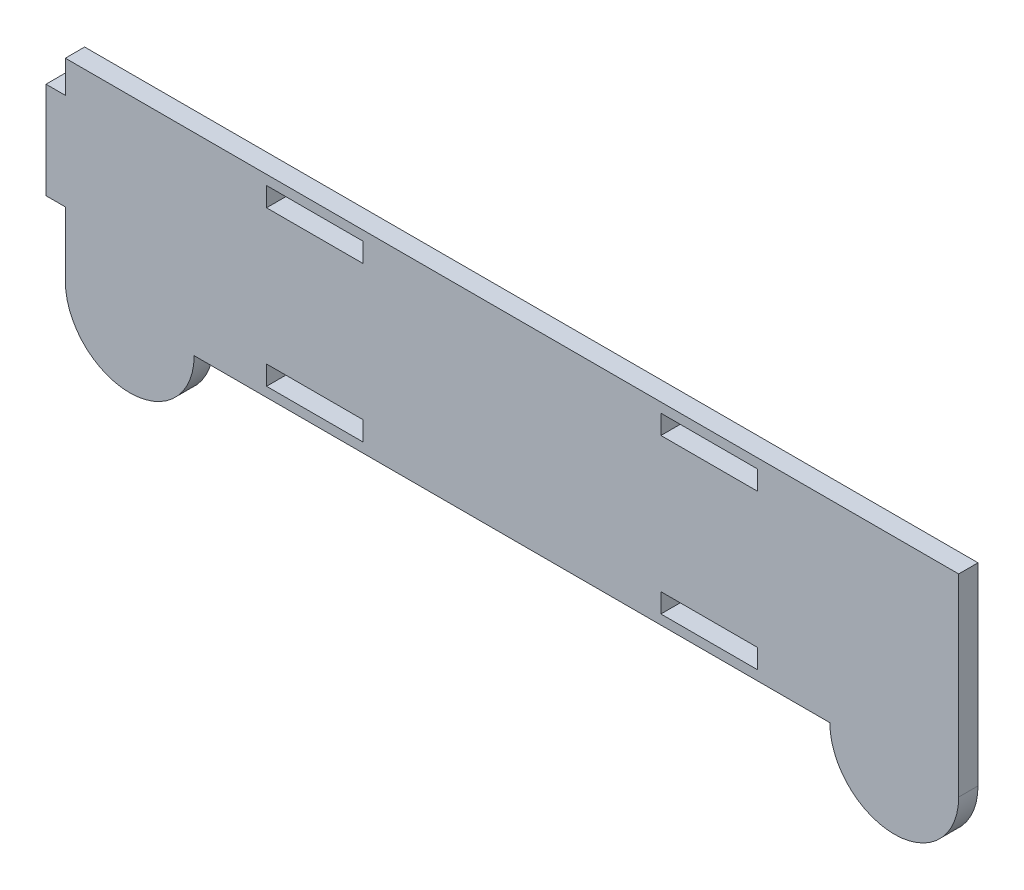
ISO-10303-21;
HEADER;
FILE_DESCRIPTION(('STEP AP214'),'2;1');
FILE_NAME('part.step','',(''),(''),'','','');
FILE_SCHEMA(('AUTOMOTIVE_DESIGN { 1 0 10303 214 1 1 1 1 }'));
ENDSEC;
DATA;
#1=APPLICATION_CONTEXT('core data for automotive mechanical design processes');
#2=APPLICATION_PROTOCOL_DEFINITION('international standard','automotive_design',2000,#1);
#3=PRODUCT_CONTEXT('',#1,'mechanical');
#4=PRODUCT('Part','Part','',(#3));
#5=PRODUCT_RELATED_PRODUCT_CATEGORY('part','',(#4));
#6=PRODUCT_DEFINITION_FORMATION('','',#4);
#7=PRODUCT_DEFINITION_CONTEXT('part definition',#1,'design');
#8=PRODUCT_DEFINITION('design','',#6,#7);
#9=PRODUCT_DEFINITION_SHAPE('','',#8);
#10=(LENGTH_UNIT() NAMED_UNIT(*) SI_UNIT(.MILLI.,.METRE.));
#11=(NAMED_UNIT(*) PLANE_ANGLE_UNIT() SI_UNIT($,.RADIAN.));
#12=(NAMED_UNIT(*) SI_UNIT($,.STERADIAN.) SOLID_ANGLE_UNIT());
#13=UNCERTAINTY_MEASURE_WITH_UNIT(LENGTH_MEASURE(1.E-05),#10,'distance_accuracy_value','');
#14=(GEOMETRIC_REPRESENTATION_CONTEXT(3) GLOBAL_UNCERTAINTY_ASSIGNED_CONTEXT((#13)) GLOBAL_UNIT_ASSIGNED_CONTEXT((#10,
#11,#12)) REPRESENTATION_CONTEXT('',''));
#15=CARTESIAN_POINT('',(0.,0.,0.));
#16=DIRECTION('',(0.,0.,1.));
#17=DIRECTION('',(1.,0.,0.));
#18=AXIS2_PLACEMENT_3D('',#15,#16,#17);
#19=CARTESIAN_POINT('',(-3.,18.9590951299038,3.));
#20=DIRECTION('',(0.,1.,0.));
#21=DIRECTION('',(0.,0.,1.));
#22=AXIS2_PLACEMENT_3D('',#19,#20,#21);
#23=PLANE('',#22);
#24=DIRECTION('',(1.,0.,0.));
#25=VECTOR('',#24,1.);
#26=CARTESIAN_POINT('',(-3.,18.9590951299038,0.));
#27=LINE('',#26,#25);
#28=CARTESIAN_POINT('',(-3.,18.9590951299038,0.));
#29=VERTEX_POINT('',#28);
#30=CARTESIAN_POINT('',(0.,18.9590951299038,0.));
#31=VERTEX_POINT('',#30);
#32=EDGE_CURVE('E331',#29,#31,#27,.T.);
#33=ORIENTED_EDGE('',*,*,#32,.T.);
#34=DIRECTION('',(0.,0.,-1.));
#35=VECTOR('',#34,1.);
#36=CARTESIAN_POINT('',(0.,18.9590951299038,3.));
#37=LINE('',#36,#35);
#38=CARTESIAN_POINT('',(0.,18.9590951299038,3.));
#39=VERTEX_POINT('',#38);
#40=EDGE_CURVE('E11',#39,#31,#37,.T.);
#41=ORIENTED_EDGE('',*,*,#40,.F.);
#42=DIRECTION('',(1.,0.,0.));
#43=VECTOR('',#42,1.);
#44=CARTESIAN_POINT('',(-3.,18.9590951299038,3.));
#45=LINE('',#44,#43);
#46=CARTESIAN_POINT('',(-3.,18.9590951299038,3.));
#47=VERTEX_POINT('',#46);
#48=EDGE_CURVE('E338',#47,#39,#45,.T.);
#49=ORIENTED_EDGE('',*,*,#48,.F.);
#50=DIRECTION('',(0.,0.,-1.));
#51=VECTOR('',#50,1.);
#52=CARTESIAN_POINT('',(-3.,18.9590951299038,3.));
#53=LINE('',#52,#51);
#54=EDGE_CURVE('E360',#47,#29,#53,.T.);
#55=ORIENTED_EDGE('',*,*,#54,.T.);
#56=EDGE_LOOP('',(#33,#41,#49,#55));
#57=FACE_BOUND('',#56,.T.);
#58=ADVANCED_FACE('F33',(#57),#23,.F.);
#59=CARTESIAN_POINT('',(0.,18.9590951299038,3.));
#60=DIRECTION('',(1.,0.,0.));
#61=DIRECTION('',(0.,1.,0.));
#62=AXIS2_PLACEMENT_3D('',#59,#60,#61);
#63=PLANE('',#62);
#64=DIRECTION('',(0.,-1.,0.));
#65=VECTOR('',#64,1.);
#66=CARTESIAN_POINT('',(0.,18.9590951299038,0.));
#67=LINE('',#66,#65);
#68=CARTESIAN_POINT('',(0.,8.95909512990378,0.));
#69=VERTEX_POINT('',#68);
#70=EDGE_CURVE('E363',#31,#69,#67,.T.);
#71=ORIENTED_EDGE('',*,*,#70,.T.);
#72=DIRECTION('',(0.,0.,-1.));
#73=VECTOR('',#72,1.);
#74=CARTESIAN_POINT('',(0.,8.95909512990378,3.));
#75=LINE('',#74,#73);
#76=CARTESIAN_POINT('',(0.,8.95909512990378,3.));
#77=VERTEX_POINT('',#76);
#78=EDGE_CURVE('E40',#77,#69,#75,.T.);
#79=ORIENTED_EDGE('',*,*,#78,.F.);
#80=DIRECTION('',(0.,-1.,0.));
#81=VECTOR('',#80,1.);
#82=CARTESIAN_POINT('',(0.,18.9590951299038,3.));
#83=LINE('',#82,#81);
#84=EDGE_CURVE('E341',#39,#77,#83,.T.);
#85=ORIENTED_EDGE('',*,*,#84,.F.);
#86=ORIENTED_EDGE('',*,*,#40,.T.);
#87=EDGE_LOOP('',(#71,#79,#85,#86));
#88=FACE_BOUND('',#87,.T.);
#89=ADVANCED_FACE('F429',(#88),#63,.F.);
#90=CARTESIAN_POINT('',(10.,8.95909512990378,3.));
#91=DIRECTION('',(0.,0.,-1.));
#92=DIRECTION('',(-1.,0.,0.));
#93=AXIS2_PLACEMENT_3D('',#90,#91,#92);
#94=CYLINDRICAL_SURFACE('',#93,10.);
#95=CARTESIAN_POINT('',(10.,8.95909512990378,0.));
#96=DIRECTION('',(0.,0.,1.));
#97=DIRECTION('',(1.,0.,0.));
#98=AXIS2_PLACEMENT_3D('',#95,#96,#97);
#99=CIRCLE('',#98,10.);
#100=CARTESIAN_POINT('',(20.,8.95909512990378,0.));
#101=VERTEX_POINT('',#100);
#102=EDGE_CURVE('E365',#69,#101,#99,.T.);
#103=ORIENTED_EDGE('',*,*,#102,.T.);
#104=DIRECTION('',(0.,0.,-1.));
#105=VECTOR('',#104,1.);
#106=CARTESIAN_POINT('',(20.,8.95909512990378,3.));
#107=LINE('',#106,#105);
#108=CARTESIAN_POINT('',(20.,8.95909512990378,3.));
#109=VERTEX_POINT('',#108);
#110=EDGE_CURVE('E400',#109,#101,#107,.T.);
#111=ORIENTED_EDGE('',*,*,#110,.F.);
#112=CARTESIAN_POINT('',(10.,8.95909512990378,3.));
#113=DIRECTION('',(0.,0.,1.));
#114=DIRECTION('',(1.,0.,0.));
#115=AXIS2_PLACEMENT_3D('',#112,#113,#114);
#116=CIRCLE('',#115,10.);
#117=EDGE_CURVE('E344',#77,#109,#116,.T.);
#118=ORIENTED_EDGE('',*,*,#117,.F.);
#119=ORIENTED_EDGE('',*,*,#78,.T.);
#120=EDGE_LOOP('',(#103,#111,#118,#119));
#121=FACE_BOUND('',#120,.T.);
#122=ADVANCED_FACE('F407',(#121),#94,.T.);
#123=CARTESIAN_POINT('',(20.,8.95909512990378,3.));
#124=DIRECTION('',(0.,1.,0.));
#125=DIRECTION('',(-1.,0.,0.));
#126=AXIS2_PLACEMENT_3D('',#123,#124,#125);
#127=PLANE('',#126);
#128=DIRECTION('',(1.,0.,0.));
#129=VECTOR('',#128,1.);
#130=CARTESIAN_POINT('',(20.,8.95909512990378,0.));
#131=LINE('',#130,#129);
#132=CARTESIAN_POINT('',(118.7,8.95909512990379,0.));
#133=VERTEX_POINT('',#132);
#134=EDGE_CURVE('E367',#101,#133,#131,.T.);
#135=ORIENTED_EDGE('',*,*,#134,.T.);
#136=DIRECTION('',(0.,0.,-1.));
#137=VECTOR('',#136,1.);
#138=CARTESIAN_POINT('',(118.7,8.95909512990379,3.));
#139=LINE('',#138,#137);
#140=CARTESIAN_POINT('',(118.7,8.95909512990379,3.));
#141=VERTEX_POINT('',#140);
#142=EDGE_CURVE('E397',#141,#133,#139,.T.);
#143=ORIENTED_EDGE('',*,*,#142,.F.);
#144=DIRECTION('',(1.,0.,0.));
#145=VECTOR('',#144,1.);
#146=CARTESIAN_POINT('',(20.,8.95909512990378,3.));
#147=LINE('',#146,#145);
#148=EDGE_CURVE('E346',#109,#141,#147,.T.);
#149=ORIENTED_EDGE('',*,*,#148,.F.);
#150=ORIENTED_EDGE('',*,*,#110,.T.);
#151=EDGE_LOOP('',(#135,#143,#149,#150));
#152=FACE_BOUND('',#151,.T.);
#153=ADVANCED_FACE('F417',(#152),#127,.F.);
#154=CARTESIAN_POINT('',(128.7,8.95909512990379,3.));
#155=DIRECTION('',(0.,0.,-1.));
#156=DIRECTION('',(-1.,0.,0.));
#157=AXIS2_PLACEMENT_3D('',#154,#155,#156);
#158=CYLINDRICAL_SURFACE('',#157,9.99999999999999);
#159=CARTESIAN_POINT('',(128.7,8.95909512990379,0.));
#160=DIRECTION('',(0.,0.,1.));
#161=DIRECTION('',(-1.,0.,0.));
#162=AXIS2_PLACEMENT_3D('',#159,#160,#161);
#163=CIRCLE('',#162,9.99999999999999);
#164=CARTESIAN_POINT('',(138.7,8.95909512990379,0.));
#165=VERTEX_POINT('',#164);
#166=EDGE_CURVE('E369',#133,#165,#163,.T.);
#167=ORIENTED_EDGE('',*,*,#166,.T.);
#168=DIRECTION('',(0.,0.,-1.));
#169=VECTOR('',#168,1.);
#170=CARTESIAN_POINT('',(138.7,8.95909512990379,3.));
#171=LINE('',#170,#169);
#172=CARTESIAN_POINT('',(138.7,8.95909512990379,3.));
#173=VERTEX_POINT('',#172);
#174=EDGE_CURVE('E394',#173,#165,#171,.T.);
#175=ORIENTED_EDGE('',*,*,#174,.F.);
#176=CARTESIAN_POINT('',(128.7,8.95909512990379,3.));
#177=DIRECTION('',(0.,0.,1.));
#178=DIRECTION('',(-1.,0.,0.));
#179=AXIS2_PLACEMENT_3D('',#176,#177,#178);
#180=CIRCLE('',#179,9.99999999999999);
#181=EDGE_CURVE('E348',#141,#173,#180,.T.);
#182=ORIENTED_EDGE('',*,*,#181,.F.);
#183=ORIENTED_EDGE('',*,*,#142,.T.);
#184=EDGE_LOOP('',(#167,#175,#182,#183));
#185=FACE_BOUND('',#184,.T.);
#186=ADVANCED_FACE('F421',(#185),#158,.T.);
#187=CARTESIAN_POINT('',(138.7,8.95909512990379,3.));
#188=DIRECTION('',(-1.,0.,0.));
#189=DIRECTION('',(0.,0.,1.));
#190=AXIS2_PLACEMENT_3D('',#187,#188,#189);
#191=PLANE('',#190);
#192=DIRECTION('',(0.,1.,0.));
#193=VECTOR('',#192,1.);
#194=CARTESIAN_POINT('',(138.7,8.95909512990379,0.));
#195=LINE('',#194,#193);
#196=CARTESIAN_POINT('',(138.7,38.9590951299038,0.));
#197=VERTEX_POINT('',#196);
#198=EDGE_CURVE('E371',#165,#197,#195,.T.);
#199=ORIENTED_EDGE('',*,*,#198,.T.);
#200=DIRECTION('',(0.,0.,-1.));
#201=VECTOR('',#200,1.);
#202=CARTESIAN_POINT('',(138.7,38.9590951299038,3.));
#203=LINE('',#202,#201);
#204=CARTESIAN_POINT('',(138.7,38.9590951299038,3.));
#205=VERTEX_POINT('',#204);
#206=EDGE_CURVE('E391',#205,#197,#203,.T.);
#207=ORIENTED_EDGE('',*,*,#206,.F.);
#208=DIRECTION('',(0.,1.,0.));
#209=VECTOR('',#208,1.);
#210=CARTESIAN_POINT('',(138.7,8.95909512990379,3.));
#211=LINE('',#210,#209);
#212=EDGE_CURVE('E350',#173,#205,#211,.T.);
#213=ORIENTED_EDGE('',*,*,#212,.F.);
#214=ORIENTED_EDGE('',*,*,#174,.T.);
#215=EDGE_LOOP('',(#199,#207,#213,#214));
#216=FACE_BOUND('',#215,.T.);
#217=ADVANCED_FACE('F452',(#216),#191,.F.);
#218=CARTESIAN_POINT('',(0.,38.9590951299038,3.));
#219=DIRECTION('',(0.,-1.,0.));
#220=DIRECTION('',(0.,0.,-1.));
#221=AXIS2_PLACEMENT_3D('',#218,#219,#220);
#222=PLANE('',#221);
#223=DIRECTION('',(-1.,0.,0.));
#224=VECTOR('',#223,1.);
#225=CARTESIAN_POINT('',(0.,38.9590951299038,0.));
#226=LINE('',#225,#224);
#227=CARTESIAN_POINT('',(0.,38.9590951299038,0.));
#228=VERTEX_POINT('',#227);
#229=EDGE_CURVE('E373',#197,#228,#226,.T.);
#230=ORIENTED_EDGE('',*,*,#229,.T.);
#231=DIRECTION('',(0.,0.,-1.));
#232=VECTOR('',#231,1.);
#233=CARTESIAN_POINT('',(0.,38.9590951299038,3.));
#234=LINE('',#233,#232);
#235=CARTESIAN_POINT('',(0.,38.9590951299038,3.));
#236=VERTEX_POINT('',#235);
#237=EDGE_CURVE('E388',#236,#228,#234,.T.);
#238=ORIENTED_EDGE('',*,*,#237,.F.);
#239=DIRECTION('',(-1.,0.,0.));
#240=VECTOR('',#239,1.);
#241=CARTESIAN_POINT('',(0.,38.9590951299038,3.));
#242=LINE('',#241,#240);
#243=EDGE_CURVE('E352',#205,#236,#242,.T.);
#244=ORIENTED_EDGE('',*,*,#243,.F.);
#245=ORIENTED_EDGE('',*,*,#206,.T.);
#246=EDGE_LOOP('',(#230,#238,#244,#245));
#247=FACE_BOUND('',#246,.T.);
#248=ADVANCED_FACE('F449',(#247),#222,.F.);
#249=CARTESIAN_POINT('',(0.,38.9590951299038,3.));
#250=DIRECTION('',(1.,0.,0.));
#251=DIRECTION('',(0.,1.,0.));
#252=AXIS2_PLACEMENT_3D('',#249,#250,#251);
#253=PLANE('',#252);
#254=DIRECTION('',(0.,-1.,0.));
#255=VECTOR('',#254,1.);
#256=CARTESIAN_POINT('',(0.,38.9590951299038,0.));
#257=LINE('',#256,#255);
#258=CARTESIAN_POINT('',(0.,33.9590951299038,0.));
#259=VERTEX_POINT('',#258);
#260=EDGE_CURVE('E375',#228,#259,#257,.T.);
#261=ORIENTED_EDGE('',*,*,#260,.T.);
#262=DIRECTION('',(0.,0.,-1.));
#263=VECTOR('',#262,1.);
#264=CARTESIAN_POINT('',(0.,33.9590951299038,3.));
#265=LINE('',#264,#263);
#266=CARTESIAN_POINT('',(0.,33.9590951299038,3.));
#267=VERTEX_POINT('',#266);
#268=EDGE_CURVE('E385',#267,#259,#265,.T.);
#269=ORIENTED_EDGE('',*,*,#268,.F.);
#270=DIRECTION('',(0.,-1.,0.));
#271=VECTOR('',#270,1.);
#272=CARTESIAN_POINT('',(0.,38.9590951299038,3.));
#273=LINE('',#272,#271);
#274=EDGE_CURVE('E354',#236,#267,#273,.T.);
#275=ORIENTED_EDGE('',*,*,#274,.F.);
#276=ORIENTED_EDGE('',*,*,#237,.T.);
#277=EDGE_LOOP('',(#261,#269,#275,#276));
#278=FACE_BOUND('',#277,.T.);
#279=ADVANCED_FACE('F445',(#278),#253,.F.);
#280=CARTESIAN_POINT('',(0.,33.9590951299038,3.));
#281=DIRECTION('',(0.,-1.,0.));
#282=DIRECTION('',(0.,0.,-1.));
#283=AXIS2_PLACEMENT_3D('',#280,#281,#282);
#284=PLANE('',#283);
#285=DIRECTION('',(-1.,0.,0.));
#286=VECTOR('',#285,1.);
#287=CARTESIAN_POINT('',(0.,33.9590951299038,0.));
#288=LINE('',#287,#286);
#289=CARTESIAN_POINT('',(-3.,33.9590951299038,0.));
#290=VERTEX_POINT('',#289);
#291=EDGE_CURVE('E377',#259,#290,#288,.T.);
#292=ORIENTED_EDGE('',*,*,#291,.T.);
#293=DIRECTION('',(0.,0.,-1.));
#294=VECTOR('',#293,1.);
#295=CARTESIAN_POINT('',(-3.,33.9590951299038,3.));
#296=LINE('',#295,#294);
#297=CARTESIAN_POINT('',(-3.,33.9590951299038,3.));
#298=VERTEX_POINT('',#297);
#299=EDGE_CURVE('E382',#298,#290,#296,.T.);
#300=ORIENTED_EDGE('',*,*,#299,.F.);
#301=DIRECTION('',(-1.,0.,0.));
#302=VECTOR('',#301,1.);
#303=CARTESIAN_POINT('',(0.,33.9590951299038,3.));
#304=LINE('',#303,#302);
#305=EDGE_CURVE('E356',#267,#298,#304,.T.);
#306=ORIENTED_EDGE('',*,*,#305,.F.);
#307=ORIENTED_EDGE('',*,*,#268,.T.);
#308=EDGE_LOOP('',(#292,#300,#306,#307));
#309=FACE_BOUND('',#308,.T.);
#310=ADVANCED_FACE('F441',(#309),#284,.F.);
#311=CARTESIAN_POINT('',(-3.,33.9590951299038,3.));
#312=DIRECTION('',(1.,0.,0.));
#313=DIRECTION('',(0.,1.,0.));
#314=AXIS2_PLACEMENT_3D('',#311,#312,#313);
#315=PLANE('',#314);
#316=DIRECTION('',(0.,-1.,0.));
#317=VECTOR('',#316,1.);
#318=CARTESIAN_POINT('',(-3.,33.9590951299038,0.));
#319=LINE('',#318,#317);
#320=EDGE_CURVE('E342',#290,#29,#319,.T.);
#321=ORIENTED_EDGE('',*,*,#320,.T.);
#322=ORIENTED_EDGE('',*,*,#54,.F.);
#323=DIRECTION('',(0.,-1.,0.));
#324=VECTOR('',#323,1.);
#325=CARTESIAN_POINT('',(-3.,33.9590951299038,3.));
#326=LINE('',#325,#324);
#327=EDGE_CURVE('E358',#298,#47,#326,.T.);
#328=ORIENTED_EDGE('',*,*,#327,.F.);
#329=ORIENTED_EDGE('',*,*,#299,.T.);
#330=EDGE_LOOP('',(#321,#322,#328,#329));
#331=FACE_BOUND('',#330,.T.);
#332=ADVANCED_FACE('F436',(#331),#315,.F.);
#333=CARTESIAN_POINT('',(10.,8.95909512990378,3.));
#334=DIRECTION('',(0.,0.,1.));
#335=DIRECTION('',(1.,0.,0.));
#336=AXIS2_PLACEMENT_3D('',#333,#334,#335);
#337=PLANE('',#336);
#338=DIRECTION('',(0.,-1.,0.));
#339=VECTOR('',#338,1.);
#340=CARTESIAN_POINT('',(92.47,13.4590951299038,3.));
#341=LINE('',#340,#339);
#342=CARTESIAN_POINT('',(92.47,13.4590951299038,3.));
#343=VERTEX_POINT('',#342);
#344=CARTESIAN_POINT('',(92.47,10.4590951299038,3.));
#345=VERTEX_POINT('',#344);
#346=EDGE_CURVE('E47',#343,#345,#341,.T.);
#347=ORIENTED_EDGE('',*,*,#346,.F.);
#348=DIRECTION('',(-1.,0.,0.));
#349=VECTOR('',#348,1.);
#350=CARTESIAN_POINT('',(92.47,13.4590951299038,3.));
#351=LINE('',#350,#349);
#352=CARTESIAN_POINT('',(107.47,13.4590951299038,3.));
#353=VERTEX_POINT('',#352);
#354=EDGE_CURVE('E223',#353,#343,#351,.T.);
#355=ORIENTED_EDGE('',*,*,#354,.F.);
#356=DIRECTION('',(0.,1.,0.));
#357=VECTOR('',#356,1.);
#358=CARTESIAN_POINT('',(107.47,13.4590951299038,3.));
#359=LINE('',#358,#357);
#360=CARTESIAN_POINT('',(107.47,10.4590951299038,3.));
#361=VERTEX_POINT('',#360);
#362=EDGE_CURVE('E226',#361,#353,#359,.T.);
#363=ORIENTED_EDGE('',*,*,#362,.F.);
#364=DIRECTION('',(1.,0.,0.));
#365=VECTOR('',#364,1.);
#366=CARTESIAN_POINT('',(92.47,10.4590951299038,3.));
#367=LINE('',#366,#365);
#368=EDGE_CURVE('E232',#345,#361,#367,.T.);
#369=ORIENTED_EDGE('',*,*,#368,.F.);
#370=EDGE_LOOP('',(#347,#355,#363,#369));
#371=FACE_BOUND('',#370,.T.);
#372=DIRECTION('',(0.,-1.,0.));
#373=VECTOR('',#372,1.);
#374=CARTESIAN_POINT('',(31.24,13.4590951299038,3.));
#375=LINE('',#374,#373);
#376=CARTESIAN_POINT('',(31.24,13.4590951299038,3.));
#377=VERTEX_POINT('',#376);
#378=CARTESIAN_POINT('',(31.24,10.4590951299038,3.));
#379=VERTEX_POINT('',#378);
#380=EDGE_CURVE('E238',#377,#379,#375,.T.);
#381=ORIENTED_EDGE('',*,*,#380,.F.);
#382=DIRECTION('',(-1.,0.,0.));
#383=VECTOR('',#382,1.);
#384=CARTESIAN_POINT('',(31.24,13.4590951299038,3.));
#385=LINE('',#384,#383);
#386=CARTESIAN_POINT('',(46.24,13.4590951299038,3.));
#387=VERTEX_POINT('',#386);
#388=EDGE_CURVE('E246',#387,#377,#385,.T.);
#389=ORIENTED_EDGE('',*,*,#388,.F.);
#390=DIRECTION('',(0.,1.,0.));
#391=VECTOR('',#390,1.);
#392=CARTESIAN_POINT('',(46.24,13.4590951299038,3.));
#393=LINE('',#392,#391);
#394=CARTESIAN_POINT('',(46.24,10.4590951299038,3.));
#395=VERTEX_POINT('',#394);
#396=EDGE_CURVE('E260',#395,#387,#393,.T.);
#397=ORIENTED_EDGE('',*,*,#396,.F.);
#398=DIRECTION('',(1.,0.,0.));
#399=VECTOR('',#398,1.);
#400=CARTESIAN_POINT('',(31.24,10.4590951299038,3.));
#401=LINE('',#400,#399);
#402=EDGE_CURVE('E257',#379,#395,#401,.T.);
#403=ORIENTED_EDGE('',*,*,#402,.F.);
#404=EDGE_LOOP('',(#381,#389,#397,#403));
#405=FACE_BOUND('',#404,.T.);
#406=DIRECTION('',(0.,-1.,0.));
#407=VECTOR('',#406,1.);
#408=CARTESIAN_POINT('',(92.47,37.4590951299038,3.));
#409=LINE('',#408,#407);
#410=CARTESIAN_POINT('',(92.47,37.4590951299038,3.));
#411=VERTEX_POINT('',#410);
#412=CARTESIAN_POINT('',(92.47,34.4590951299038,3.));
#413=VERTEX_POINT('',#412);
#414=EDGE_CURVE('E267',#411,#413,#409,.T.);
#415=ORIENTED_EDGE('',*,*,#414,.F.);
#416=DIRECTION('',(-1.,0.,0.));
#417=VECTOR('',#416,1.);
#418=CARTESIAN_POINT('',(92.47,37.4590951299038,3.));
#419=LINE('',#418,#417);
#420=CARTESIAN_POINT('',(107.47,37.4590951299038,3.));
#421=VERTEX_POINT('',#420);
#422=EDGE_CURVE('E278',#421,#411,#419,.T.);
#423=ORIENTED_EDGE('',*,*,#422,.F.);
#424=DIRECTION('',(0.,1.,0.));
#425=VECTOR('',#424,1.);
#426=CARTESIAN_POINT('',(107.47,37.4590951299038,3.));
#427=LINE('',#426,#425);
#428=CARTESIAN_POINT('',(107.47,34.4590951299038,3.));
#429=VERTEX_POINT('',#428);
#430=EDGE_CURVE('E292',#429,#421,#427,.T.);
#431=ORIENTED_EDGE('',*,*,#430,.F.);
#432=DIRECTION('',(1.,0.,0.));
#433=VECTOR('',#432,1.);
#434=CARTESIAN_POINT('',(92.47,34.4590951299038,3.));
#435=LINE('',#434,#433);
#436=EDGE_CURVE('E289',#413,#429,#435,.T.);
#437=ORIENTED_EDGE('',*,*,#436,.F.);
#438=EDGE_LOOP('',(#415,#423,#431,#437));
#439=FACE_BOUND('',#438,.T.);
#440=DIRECTION('',(0.,-1.,0.));
#441=VECTOR('',#440,1.);
#442=CARTESIAN_POINT('',(31.24,37.4590951299038,3.));
#443=LINE('',#442,#441);
#444=CARTESIAN_POINT('',(31.24,37.4590951299038,3.));
#445=VERTEX_POINT('',#444);
#446=CARTESIAN_POINT('',(31.24,34.4590951299038,3.));
#447=VERTEX_POINT('',#446);
#448=EDGE_CURVE('E299',#445,#447,#443,.T.);
#449=ORIENTED_EDGE('',*,*,#448,.F.);
#450=DIRECTION('',(-1.,0.,0.));
#451=VECTOR('',#450,1.);
#452=CARTESIAN_POINT('',(31.24,37.4590951299038,3.));
#453=LINE('',#452,#451);
#454=CARTESIAN_POINT('',(46.24,37.4590951299038,3.));
#455=VERTEX_POINT('',#454);
#456=EDGE_CURVE('E310',#455,#445,#453,.T.);
#457=ORIENTED_EDGE('',*,*,#456,.F.);
#458=DIRECTION('',(0.,1.,0.));
#459=VECTOR('',#458,1.);
#460=CARTESIAN_POINT('',(46.24,37.4590951299038,3.));
#461=LINE('',#460,#459);
#462=CARTESIAN_POINT('',(46.24,34.4590951299038,3.));
#463=VERTEX_POINT('',#462);
#464=EDGE_CURVE('E324',#463,#455,#461,.T.);
#465=ORIENTED_EDGE('',*,*,#464,.F.);
#466=DIRECTION('',(1.,0.,0.));
#467=VECTOR('',#466,1.);
#468=CARTESIAN_POINT('',(31.24,34.4590951299038,3.));
#469=LINE('',#468,#467);
#470=EDGE_CURVE('E321',#447,#463,#469,.T.);
#471=ORIENTED_EDGE('',*,*,#470,.F.);
#472=EDGE_LOOP('',(#449,#457,#465,#471));
#473=FACE_BOUND('',#472,.T.);
#474=ORIENTED_EDGE('',*,*,#48,.T.);
#475=ORIENTED_EDGE('',*,*,#84,.T.);
#476=ORIENTED_EDGE('',*,*,#117,.T.);
#477=ORIENTED_EDGE('',*,*,#148,.T.);
#478=ORIENTED_EDGE('',*,*,#181,.T.);
#479=ORIENTED_EDGE('',*,*,#212,.T.);
#480=ORIENTED_EDGE('',*,*,#243,.T.);
#481=ORIENTED_EDGE('',*,*,#274,.T.);
#482=ORIENTED_EDGE('',*,*,#305,.T.);
#483=ORIENTED_EDGE('',*,*,#327,.T.);
#484=EDGE_LOOP('',(#474,#475,#476,#477,#478,#479,#480,#481,#482,#483));
#485=FACE_BOUND('',#484,.T.);
#486=ADVANCED_FACE('F425',(#371,#405,#439,#473,#485),#337,.T.);
#487=CARTESIAN_POINT('',(10.,8.95909512990378,0.));
#488=DIRECTION('',(0.,0.,1.));
#489=DIRECTION('',(1.,0.,0.));
#490=AXIS2_PLACEMENT_3D('',#487,#488,#489);
#491=PLANE('',#490);
#492=DIRECTION('',(-1.,0.,0.));
#493=VECTOR('',#492,1.);
#494=CARTESIAN_POINT('',(92.47,13.4590951299038,0.));
#495=LINE('',#494,#493);
#496=CARTESIAN_POINT('',(107.47,13.4590951299038,0.));
#497=VERTEX_POINT('',#496);
#498=CARTESIAN_POINT('',(92.47,13.4590951299038,0.));
#499=VERTEX_POINT('',#498);
#500=EDGE_CURVE('E213',#497,#499,#495,.T.);
#501=ORIENTED_EDGE('',*,*,#500,.T.);
#502=DIRECTION('',(0.,-1.,0.));
#503=VECTOR('',#502,1.);
#504=CARTESIAN_POINT('',(92.47,13.4590951299038,0.));
#505=LINE('',#504,#503);
#506=CARTESIAN_POINT('',(92.47,10.4590951299038,0.));
#507=VERTEX_POINT('',#506);
#508=EDGE_CURVE('E207',#499,#507,#505,.T.);
#509=ORIENTED_EDGE('',*,*,#508,.T.);
#510=DIRECTION('',(1.,0.,0.));
#511=VECTOR('',#510,1.);
#512=CARTESIAN_POINT('',(92.47,10.4590951299038,0.));
#513=LINE('',#512,#511);
#514=CARTESIAN_POINT('',(107.47,10.4590951299038,0.));
#515=VERTEX_POINT('',#514);
#516=EDGE_CURVE('E216',#507,#515,#513,.T.);
#517=ORIENTED_EDGE('',*,*,#516,.T.);
#518=DIRECTION('',(0.,1.,0.));
#519=VECTOR('',#518,1.);
#520=CARTESIAN_POINT('',(107.47,13.4590951299038,0.));
#521=LINE('',#520,#519);
#522=EDGE_CURVE('E55',#515,#497,#521,.T.);
#523=ORIENTED_EDGE('',*,*,#522,.T.);
#524=EDGE_LOOP('',(#501,#509,#517,#523));
#525=FACE_BOUND('',#524,.T.);
#526=DIRECTION('',(-1.,0.,0.));
#527=VECTOR('',#526,1.);
#528=CARTESIAN_POINT('',(31.24,13.4590951299038,0.));
#529=LINE('',#528,#527);
#530=CARTESIAN_POINT('',(46.24,13.4590951299038,0.));
#531=VERTEX_POINT('',#530);
#532=CARTESIAN_POINT('',(31.24,13.4590951299038,0.));
#533=VERTEX_POINT('',#532);
#534=EDGE_CURVE('E252',#531,#533,#529,.T.);
#535=ORIENTED_EDGE('',*,*,#534,.T.);
#536=DIRECTION('',(0.,-1.,0.));
#537=VECTOR('',#536,1.);
#538=CARTESIAN_POINT('',(31.24,13.4590951299038,0.));
#539=LINE('',#538,#537);
#540=CARTESIAN_POINT('',(31.24,10.4590951299038,0.));
#541=VERTEX_POINT('',#540);
#542=EDGE_CURVE('E242',#533,#541,#539,.T.);
#543=ORIENTED_EDGE('',*,*,#542,.T.);
#544=DIRECTION('',(1.,0.,0.));
#545=VECTOR('',#544,1.);
#546=CARTESIAN_POINT('',(31.24,10.4590951299038,0.));
#547=LINE('',#546,#545);
#548=CARTESIAN_POINT('',(46.24,10.4590951299038,0.));
#549=VERTEX_POINT('',#548);
#550=EDGE_CURVE('E245',#541,#549,#547,.T.);
#551=ORIENTED_EDGE('',*,*,#550,.T.);
#552=DIRECTION('',(0.,1.,0.));
#553=VECTOR('',#552,1.);
#554=CARTESIAN_POINT('',(46.24,13.4590951299038,0.));
#555=LINE('',#554,#553);
#556=EDGE_CURVE('E249',#549,#531,#555,.T.);
#557=ORIENTED_EDGE('',*,*,#556,.T.);
#558=EDGE_LOOP('',(#535,#543,#551,#557));
#559=FACE_BOUND('',#558,.T.);
#560=DIRECTION('',(-1.,0.,0.));
#561=VECTOR('',#560,1.);
#562=CARTESIAN_POINT('',(92.47,37.4590951299038,0.));
#563=LINE('',#562,#561);
#564=CARTESIAN_POINT('',(107.47,37.4590951299038,0.));
#565=VERTEX_POINT('',#564);
#566=CARTESIAN_POINT('',(92.47,37.4590951299038,0.));
#567=VERTEX_POINT('',#566);
#568=EDGE_CURVE('E284',#565,#567,#563,.T.);
#569=ORIENTED_EDGE('',*,*,#568,.T.);
#570=DIRECTION('',(0.,-1.,0.));
#571=VECTOR('',#570,1.);
#572=CARTESIAN_POINT('',(92.47,37.4590951299038,0.));
#573=LINE('',#572,#571);
#574=CARTESIAN_POINT('',(92.47,34.4590951299038,0.));
#575=VERTEX_POINT('',#574);
#576=EDGE_CURVE('E274',#567,#575,#573,.T.);
#577=ORIENTED_EDGE('',*,*,#576,.T.);
#578=DIRECTION('',(1.,0.,0.));
#579=VECTOR('',#578,1.);
#580=CARTESIAN_POINT('',(92.47,34.4590951299038,0.));
#581=LINE('',#580,#579);
#582=CARTESIAN_POINT('',(107.47,34.4590951299038,0.));
#583=VERTEX_POINT('',#582);
#584=EDGE_CURVE('E277',#575,#583,#581,.T.);
#585=ORIENTED_EDGE('',*,*,#584,.T.);
#586=DIRECTION('',(0.,1.,0.));
#587=VECTOR('',#586,1.);
#588=CARTESIAN_POINT('',(107.47,37.4590951299038,0.));
#589=LINE('',#588,#587);
#590=EDGE_CURVE('E281',#583,#565,#589,.T.);
#591=ORIENTED_EDGE('',*,*,#590,.T.);
#592=EDGE_LOOP('',(#569,#577,#585,#591));
#593=FACE_BOUND('',#592,.T.);
#594=DIRECTION('',(-1.,0.,0.));
#595=VECTOR('',#594,1.);
#596=CARTESIAN_POINT('',(31.24,37.4590951299038,0.));
#597=LINE('',#596,#595);
#598=CARTESIAN_POINT('',(46.24,37.4590951299038,0.));
#599=VERTEX_POINT('',#598);
#600=CARTESIAN_POINT('',(31.24,37.4590951299038,0.));
#601=VERTEX_POINT('',#600);
#602=EDGE_CURVE('E316',#599,#601,#597,.T.);
#603=ORIENTED_EDGE('',*,*,#602,.T.);
#604=DIRECTION('',(0.,-1.,0.));
#605=VECTOR('',#604,1.);
#606=CARTESIAN_POINT('',(31.24,37.4590951299038,0.));
#607=LINE('',#606,#605);
#608=CARTESIAN_POINT('',(31.24,34.4590951299038,0.));
#609=VERTEX_POINT('',#608);
#610=EDGE_CURVE('E306',#601,#609,#607,.T.);
#611=ORIENTED_EDGE('',*,*,#610,.T.);
#612=DIRECTION('',(1.,0.,0.));
#613=VECTOR('',#612,1.);
#614=CARTESIAN_POINT('',(31.24,34.4590951299038,0.));
#615=LINE('',#614,#613);
#616=CARTESIAN_POINT('',(46.24,34.4590951299038,0.));
#617=VERTEX_POINT('',#616);
#618=EDGE_CURVE('E309',#609,#617,#615,.T.);
#619=ORIENTED_EDGE('',*,*,#618,.T.);
#620=DIRECTION('',(0.,1.,0.));
#621=VECTOR('',#620,1.);
#622=CARTESIAN_POINT('',(46.24,37.4590951299038,0.));
#623=LINE('',#622,#621);
#624=EDGE_CURVE('E313',#617,#599,#623,.T.);
#625=ORIENTED_EDGE('',*,*,#624,.T.);
#626=EDGE_LOOP('',(#603,#611,#619,#625));
#627=FACE_BOUND('',#626,.T.);
#628=ORIENTED_EDGE('',*,*,#32,.F.);
#629=ORIENTED_EDGE('',*,*,#320,.F.);
#630=ORIENTED_EDGE('',*,*,#291,.F.);
#631=ORIENTED_EDGE('',*,*,#260,.F.);
#632=ORIENTED_EDGE('',*,*,#229,.F.);
#633=ORIENTED_EDGE('',*,*,#198,.F.);
#634=ORIENTED_EDGE('',*,*,#166,.F.);
#635=ORIENTED_EDGE('',*,*,#134,.F.);
#636=ORIENTED_EDGE('',*,*,#102,.F.);
#637=ORIENTED_EDGE('',*,*,#70,.F.);
#638=EDGE_LOOP('',(#628,#629,#630,#631,#632,#633,#634,#635,#636,#637));
#639=FACE_BOUND('',#638,.T.);
#640=ADVANCED_FACE('F220',(#525,#559,#593,#627,#639),#491,.F.);
#641=CARTESIAN_POINT('',(31.24,37.4590951299038,0.));
#642=DIRECTION('',(-1.,0.,0.));
#643=DIRECTION('',(0.,-1.,0.));
#644=AXIS2_PLACEMENT_3D('',#641,#642,#643);
#645=PLANE('',#644);
#646=ORIENTED_EDGE('',*,*,#448,.T.);
#647=DIRECTION('',(0.,0.,1.));
#648=VECTOR('',#647,1.);
#649=CARTESIAN_POINT('',(31.24,34.4590951299038,0.));
#650=LINE('',#649,#648);
#651=EDGE_CURVE('E319',#609,#447,#650,.T.);
#652=ORIENTED_EDGE('',*,*,#651,.F.);
#653=ORIENTED_EDGE('',*,*,#610,.F.);
#654=DIRECTION('',(0.,0.,1.));
#655=VECTOR('',#654,1.);
#656=CARTESIAN_POINT('',(31.24,37.4590951299038,0.));
#657=LINE('',#656,#655);
#658=EDGE_CURVE('E329',#601,#445,#657,.T.);
#659=ORIENTED_EDGE('',*,*,#658,.T.);
#660=EDGE_LOOP('',(#646,#652,#653,#659));
#661=FACE_BOUND('',#660,.T.);
#662=ADVANCED_FACE('F531',(#661),#645,.F.);
#663=CARTESIAN_POINT('',(31.24,37.4590951299038,0.));
#664=DIRECTION('',(0.,1.,0.));
#665=DIRECTION('',(-1.,0.,0.));
#666=AXIS2_PLACEMENT_3D('',#663,#664,#665);
#667=PLANE('',#666);
#668=ORIENTED_EDGE('',*,*,#456,.T.);
#669=ORIENTED_EDGE('',*,*,#658,.F.);
#670=ORIENTED_EDGE('',*,*,#602,.F.);
#671=DIRECTION('',(0.,0.,1.));
#672=VECTOR('',#671,1.);
#673=CARTESIAN_POINT('',(46.24,37.4590951299038,0.));
#674=LINE('',#673,#672);
#675=EDGE_CURVE('E332',#599,#455,#674,.T.);
#676=ORIENTED_EDGE('',*,*,#675,.T.);
#677=EDGE_LOOP('',(#668,#669,#670,#676));
#678=FACE_BOUND('',#677,.T.);
#679=ADVANCED_FACE('F540',(#678),#667,.F.);
#680=CARTESIAN_POINT('',(46.24,37.4590951299038,0.));
#681=DIRECTION('',(1.,0.,0.));
#682=DIRECTION('',(0.,0.,-1.));
#683=AXIS2_PLACEMENT_3D('',#680,#681,#682);
#684=PLANE('',#683);
#685=ORIENTED_EDGE('',*,*,#464,.T.);
#686=ORIENTED_EDGE('',*,*,#675,.F.);
#687=ORIENTED_EDGE('',*,*,#624,.F.);
#688=DIRECTION('',(0.,0.,1.));
#689=VECTOR('',#688,1.);
#690=CARTESIAN_POINT('',(46.24,34.4590951299038,0.));
#691=LINE('',#690,#689);
#692=EDGE_CURVE('E334',#617,#463,#691,.T.);
#693=ORIENTED_EDGE('',*,*,#692,.T.);
#694=EDGE_LOOP('',(#685,#686,#687,#693));
#695=FACE_BOUND('',#694,.T.);
#696=ADVANCED_FACE('F550',(#695),#684,.F.);
#697=CARTESIAN_POINT('',(31.24,34.4590951299038,0.));
#698=DIRECTION('',(0.,-1.,0.));
#699=DIRECTION('',(0.,0.,-1.));
#700=AXIS2_PLACEMENT_3D('',#697,#698,#699);
#701=PLANE('',#700);
#702=ORIENTED_EDGE('',*,*,#470,.T.);
#703=ORIENTED_EDGE('',*,*,#692,.F.);
#704=ORIENTED_EDGE('',*,*,#618,.F.);
#705=ORIENTED_EDGE('',*,*,#651,.T.);
#706=EDGE_LOOP('',(#702,#703,#704,#705));
#707=FACE_BOUND('',#706,.T.);
#708=ADVANCED_FACE('F560',(#707),#701,.F.);
#709=CARTESIAN_POINT('',(92.47,37.4590951299038,0.));
#710=DIRECTION('',(-1.,0.,0.));
#711=DIRECTION('',(0.,-1.,0.));
#712=AXIS2_PLACEMENT_3D('',#709,#710,#711);
#713=PLANE('',#712);
#714=ORIENTED_EDGE('',*,*,#414,.T.);
#715=DIRECTION('',(0.,0.,1.));
#716=VECTOR('',#715,1.);
#717=CARTESIAN_POINT('',(92.47,34.4590951299038,0.));
#718=LINE('',#717,#716);
#719=EDGE_CURVE('E287',#575,#413,#718,.T.);
#720=ORIENTED_EDGE('',*,*,#719,.F.);
#721=ORIENTED_EDGE('',*,*,#576,.F.);
#722=DIRECTION('',(0.,0.,1.));
#723=VECTOR('',#722,1.);
#724=CARTESIAN_POINT('',(92.47,37.4590951299038,0.));
#725=LINE('',#724,#723);
#726=EDGE_CURVE('E297',#567,#411,#725,.T.);
#727=ORIENTED_EDGE('',*,*,#726,.T.);
#728=EDGE_LOOP('',(#714,#720,#721,#727));
#729=FACE_BOUND('',#728,.T.);
#730=ADVANCED_FACE('F570',(#729),#713,.F.);
#731=CARTESIAN_POINT('',(92.47,37.4590951299038,0.));
#732=DIRECTION('',(0.,1.,0.));
#733=DIRECTION('',(0.,0.,1.));
#734=AXIS2_PLACEMENT_3D('',#731,#732,#733);
#735=PLANE('',#734);
#736=ORIENTED_EDGE('',*,*,#422,.T.);
#737=ORIENTED_EDGE('',*,*,#726,.F.);
#738=ORIENTED_EDGE('',*,*,#568,.F.);
#739=DIRECTION('',(0.,0.,1.));
#740=VECTOR('',#739,1.);
#741=CARTESIAN_POINT('',(107.47,37.4590951299038,0.));
#742=LINE('',#741,#740);
#743=EDGE_CURVE('E300',#565,#421,#742,.T.);
#744=ORIENTED_EDGE('',*,*,#743,.T.);
#745=EDGE_LOOP('',(#736,#737,#738,#744));
#746=FACE_BOUND('',#745,.T.);
#747=ADVANCED_FACE('F580',(#746),#735,.F.);
#748=CARTESIAN_POINT('',(107.47,37.4590951299038,0.));
#749=DIRECTION('',(1.,0.,0.));
#750=DIRECTION('',(0.,0.,-1.));
#751=AXIS2_PLACEMENT_3D('',#748,#749,#750);
#752=PLANE('',#751);
#753=ORIENTED_EDGE('',*,*,#430,.T.);
#754=ORIENTED_EDGE('',*,*,#743,.F.);
#755=ORIENTED_EDGE('',*,*,#590,.F.);
#756=DIRECTION('',(0.,0.,1.));
#757=VECTOR('',#756,1.);
#758=CARTESIAN_POINT('',(107.47,34.4590951299038,0.));
#759=LINE('',#758,#757);
#760=EDGE_CURVE('E302',#583,#429,#759,.T.);
#761=ORIENTED_EDGE('',*,*,#760,.T.);
#762=EDGE_LOOP('',(#753,#754,#755,#761));
#763=FACE_BOUND('',#762,.T.);
#764=ADVANCED_FACE('F590',(#763),#752,.F.);
#765=CARTESIAN_POINT('',(92.47,34.4590951299038,0.));
#766=DIRECTION('',(0.,-1.,0.));
#767=DIRECTION('',(1.,0.,0.));
#768=AXIS2_PLACEMENT_3D('',#765,#766,#767);
#769=PLANE('',#768);
#770=ORIENTED_EDGE('',*,*,#436,.T.);
#771=ORIENTED_EDGE('',*,*,#760,.F.);
#772=ORIENTED_EDGE('',*,*,#584,.F.);
#773=ORIENTED_EDGE('',*,*,#719,.T.);
#774=EDGE_LOOP('',(#770,#771,#772,#773));
#775=FACE_BOUND('',#774,.T.);
#776=ADVANCED_FACE('F600',(#775),#769,.F.);
#777=CARTESIAN_POINT('',(31.24,13.4590951299038,0.));
#778=DIRECTION('',(-1.,0.,0.));
#779=DIRECTION('',(0.,-1.,0.));
#780=AXIS2_PLACEMENT_3D('',#777,#778,#779);
#781=PLANE('',#780);
#782=ORIENTED_EDGE('',*,*,#380,.T.);
#783=DIRECTION('',(0.,0.,1.));
#784=VECTOR('',#783,1.);
#785=CARTESIAN_POINT('',(31.24,10.4590951299038,0.));
#786=LINE('',#785,#784);
#787=EDGE_CURVE('E255',#541,#379,#786,.T.);
#788=ORIENTED_EDGE('',*,*,#787,.F.);
#789=ORIENTED_EDGE('',*,*,#542,.F.);
#790=DIRECTION('',(0.,0.,1.));
#791=VECTOR('',#790,1.);
#792=CARTESIAN_POINT('',(31.24,13.4590951299038,0.));
#793=LINE('',#792,#791);
#794=EDGE_CURVE('E265',#533,#377,#793,.T.);
#795=ORIENTED_EDGE('',*,*,#794,.T.);
#796=EDGE_LOOP('',(#782,#788,#789,#795));
#797=FACE_BOUND('',#796,.T.);
#798=ADVANCED_FACE('F610',(#797),#781,.F.);
#799=CARTESIAN_POINT('',(31.24,13.4590951299038,0.));
#800=DIRECTION('',(0.,1.,0.));
#801=DIRECTION('',(0.,0.,1.));
#802=AXIS2_PLACEMENT_3D('',#799,#800,#801);
#803=PLANE('',#802);
#804=ORIENTED_EDGE('',*,*,#388,.T.);
#805=ORIENTED_EDGE('',*,*,#794,.F.);
#806=ORIENTED_EDGE('',*,*,#534,.F.);
#807=DIRECTION('',(0.,0.,1.));
#808=VECTOR('',#807,1.);
#809=CARTESIAN_POINT('',(46.24,13.4590951299038,0.));
#810=LINE('',#809,#808);
#811=EDGE_CURVE('E268',#531,#387,#810,.T.);
#812=ORIENTED_EDGE('',*,*,#811,.T.);
#813=EDGE_LOOP('',(#804,#805,#806,#812));
#814=FACE_BOUND('',#813,.T.);
#815=ADVANCED_FACE('F620',(#814),#803,.F.);
#816=CARTESIAN_POINT('',(46.24,13.4590951299038,0.));
#817=DIRECTION('',(1.,0.,0.));
#818=DIRECTION('',(0.,0.,-1.));
#819=AXIS2_PLACEMENT_3D('',#816,#817,#818);
#820=PLANE('',#819);
#821=ORIENTED_EDGE('',*,*,#396,.T.);
#822=ORIENTED_EDGE('',*,*,#811,.F.);
#823=ORIENTED_EDGE('',*,*,#556,.F.);
#824=DIRECTION('',(0.,0.,1.));
#825=VECTOR('',#824,1.);
#826=CARTESIAN_POINT('',(46.24,10.4590951299038,0.));
#827=LINE('',#826,#825);
#828=EDGE_CURVE('E270',#549,#395,#827,.T.);
#829=ORIENTED_EDGE('',*,*,#828,.T.);
#830=EDGE_LOOP('',(#821,#822,#823,#829));
#831=FACE_BOUND('',#830,.T.);
#832=ADVANCED_FACE('F630',(#831),#820,.F.);
#833=CARTESIAN_POINT('',(31.24,10.4590951299038,0.));
#834=DIRECTION('',(0.,-1.,0.));
#835=DIRECTION('',(0.,0.,-1.));
#836=AXIS2_PLACEMENT_3D('',#833,#834,#835);
#837=PLANE('',#836);
#838=ORIENTED_EDGE('',*,*,#402,.T.);
#839=ORIENTED_EDGE('',*,*,#828,.F.);
#840=ORIENTED_EDGE('',*,*,#550,.F.);
#841=ORIENTED_EDGE('',*,*,#787,.T.);
#842=EDGE_LOOP('',(#838,#839,#840,#841));
#843=FACE_BOUND('',#842,.T.);
#844=ADVANCED_FACE('F640',(#843),#837,.F.);
#845=CARTESIAN_POINT('',(92.47,13.4590951299038,0.));
#846=DIRECTION('',(-1.,0.,0.));
#847=DIRECTION('',(0.,0.,1.));
#848=AXIS2_PLACEMENT_3D('',#845,#846,#847);
#849=PLANE('',#848);
#850=ORIENTED_EDGE('',*,*,#346,.T.);
#851=DIRECTION('',(0.,0.,1.));
#852=VECTOR('',#851,1.);
#853=CARTESIAN_POINT('',(92.47,10.4590951299038,0.));
#854=LINE('',#853,#852);
#855=EDGE_CURVE('E203',#507,#345,#854,.T.);
#856=ORIENTED_EDGE('',*,*,#855,.F.);
#857=ORIENTED_EDGE('',*,*,#508,.F.);
#858=DIRECTION('',(0.,0.,1.));
#859=VECTOR('',#858,1.);
#860=CARTESIAN_POINT('',(92.47,13.4590951299038,0.));
#861=LINE('',#860,#859);
#862=EDGE_CURVE('E236',#499,#343,#861,.T.);
#863=ORIENTED_EDGE('',*,*,#862,.T.);
#864=EDGE_LOOP('',(#850,#856,#857,#863));
#865=FACE_BOUND('',#864,.T.);
#866=ADVANCED_FACE('F205',(#865),#849,.F.);
#867=CARTESIAN_POINT('',(92.47,13.4590951299038,0.));
#868=DIRECTION('',(0.,1.,0.));
#869=DIRECTION('',(0.,0.,1.));
#870=AXIS2_PLACEMENT_3D('',#867,#868,#869);
#871=PLANE('',#870);
#872=ORIENTED_EDGE('',*,*,#354,.T.);
#873=ORIENTED_EDGE('',*,*,#862,.F.);
#874=ORIENTED_EDGE('',*,*,#500,.F.);
#875=DIRECTION('',(0.,0.,1.));
#876=VECTOR('',#875,1.);
#877=CARTESIAN_POINT('',(107.47,13.4590951299038,0.));
#878=LINE('',#877,#876);
#879=EDGE_CURVE('E239',#497,#353,#878,.T.);
#880=ORIENTED_EDGE('',*,*,#879,.T.);
#881=EDGE_LOOP('',(#872,#873,#874,#880));
#882=FACE_BOUND('',#881,.T.);
#883=ADVANCED_FACE('F659',(#882),#871,.F.);
#884=CARTESIAN_POINT('',(107.47,13.4590951299038,0.));
#885=DIRECTION('',(1.,0.,0.));
#886=DIRECTION('',(0.,0.,-1.));
#887=AXIS2_PLACEMENT_3D('',#884,#885,#886);
#888=PLANE('',#887);
#889=ORIENTED_EDGE('',*,*,#362,.T.);
#890=ORIENTED_EDGE('',*,*,#879,.F.);
#891=ORIENTED_EDGE('',*,*,#522,.F.);
#892=DIRECTION('',(0.,0.,1.));
#893=VECTOR('',#892,1.);
#894=CARTESIAN_POINT('',(107.47,10.4590951299038,0.));
#895=LINE('',#894,#893);
#896=EDGE_CURVE('E212',#515,#361,#895,.T.);
#897=ORIENTED_EDGE('',*,*,#896,.T.);
#898=EDGE_LOOP('',(#889,#890,#891,#897));
#899=FACE_BOUND('',#898,.T.);
#900=ADVANCED_FACE('F668',(#899),#888,.F.);
#901=CARTESIAN_POINT('',(92.47,10.4590951299038,0.));
#902=DIRECTION('',(0.,-1.,0.));
#903=DIRECTION('',(0.,0.,-1.));
#904=AXIS2_PLACEMENT_3D('',#901,#902,#903);
#905=PLANE('',#904);
#906=ORIENTED_EDGE('',*,*,#368,.T.);
#907=ORIENTED_EDGE('',*,*,#896,.F.);
#908=ORIENTED_EDGE('',*,*,#516,.F.);
#909=ORIENTED_EDGE('',*,*,#855,.T.);
#910=EDGE_LOOP('',(#906,#907,#908,#909));
#911=FACE_BOUND('',#910,.T.);
#912=ADVANCED_FACE('F217',(#911),#905,.F.);
#913=CLOSED_SHELL('',(#58,#89,#122,#153,#186,#217,#248,#279,#310,#332,#486,#640,#662,#679,#696,
#708,#730,#747,#764,#776,#798,#815,#832,#844,#866,#883,#900,#912));
#914=MANIFOLD_SOLID_BREP('B2',#913);
#915=ADVANCED_BREP_SHAPE_REPRESENTATION('',(#18,#914),#14);
#916=SHAPE_DEFINITION_REPRESENTATION(#9,#915);
ENDSEC;
END-ISO-10303-21;
